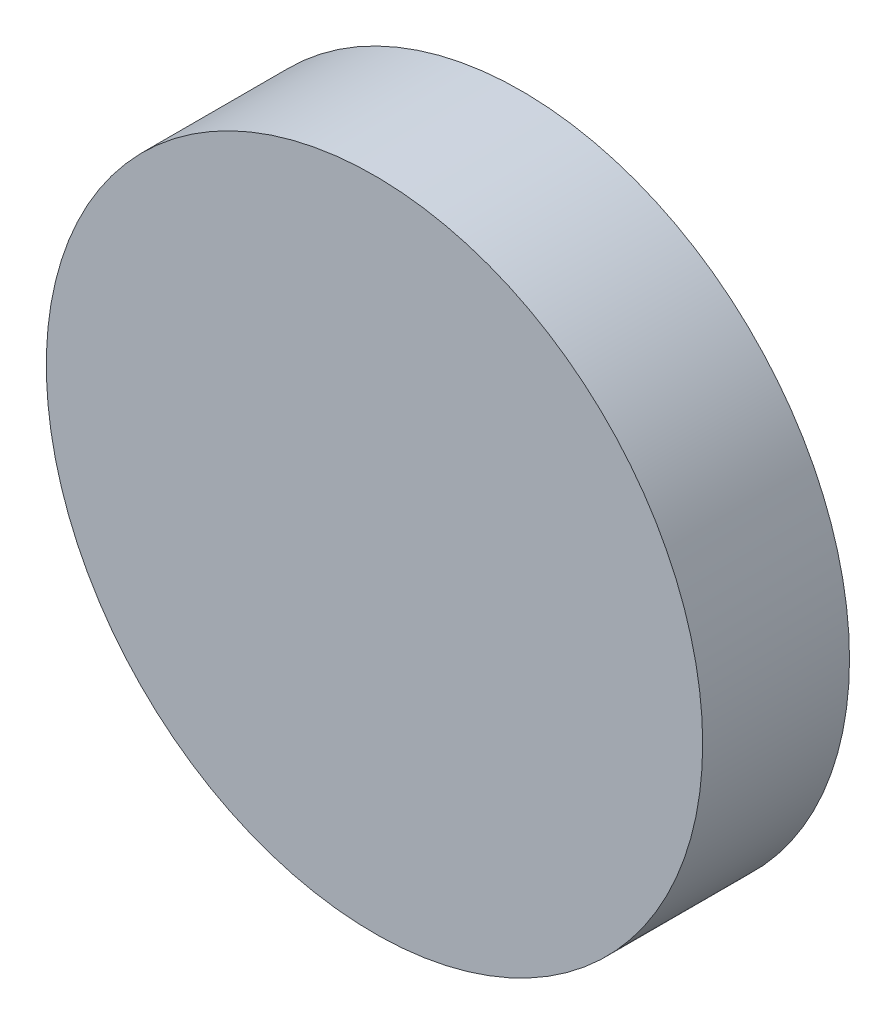
ISO-10303-21;
HEADER;
FILE_DESCRIPTION(('STEP AP214'),'2;1');
FILE_NAME('part.step','',(''),(''),'','','');
FILE_SCHEMA(('AUTOMOTIVE_DESIGN { 1 0 10303 214 1 1 1 1 }'));
ENDSEC;
DATA;
#1=APPLICATION_CONTEXT('core data for automotive mechanical design processes');
#2=APPLICATION_PROTOCOL_DEFINITION('international standard','automotive_design',2000,#1);
#3=PRODUCT_CONTEXT('',#1,'mechanical');
#4=PRODUCT('Part','Part','',(#3));
#5=PRODUCT_RELATED_PRODUCT_CATEGORY('part','',(#4));
#6=PRODUCT_DEFINITION_FORMATION('','',#4);
#7=PRODUCT_DEFINITION_CONTEXT('part definition',#1,'design');
#8=PRODUCT_DEFINITION('design','',#6,#7);
#9=PRODUCT_DEFINITION_SHAPE('','',#8);
#10=(LENGTH_UNIT() NAMED_UNIT(*) SI_UNIT(.MILLI.,.METRE.));
#11=(NAMED_UNIT(*) PLANE_ANGLE_UNIT() SI_UNIT($,.RADIAN.));
#12=(NAMED_UNIT(*) SI_UNIT($,.STERADIAN.) SOLID_ANGLE_UNIT());
#13=UNCERTAINTY_MEASURE_WITH_UNIT(LENGTH_MEASURE(1.E-05),#10,'distance_accuracy_value','');
#14=(GEOMETRIC_REPRESENTATION_CONTEXT(3) GLOBAL_UNCERTAINTY_ASSIGNED_CONTEXT((#13)) GLOBAL_UNIT_ASSIGNED_CONTEXT((#10,
#11,#12)) REPRESENTATION_CONTEXT('',''));
#15=CARTESIAN_POINT('',(0.,0.,0.));
#16=DIRECTION('',(0.,0.,1.));
#17=DIRECTION('',(1.,0.,0.));
#18=AXIS2_PLACEMENT_3D('',#15,#16,#17);
#19=CARTESIAN_POINT('',(0.,0.,127.5));
#20=DIRECTION('',(0.,0.,-1.));
#21=DIRECTION('',(-1.,0.,0.));
#22=AXIS2_PLACEMENT_3D('',#19,#20,#21);
#23=CYLINDRICAL_SURFACE('',#22,190.);
#24=CARTESIAN_POINT('',(0.,0.,127.5));
#25=DIRECTION('',(0.,0.,1.));
#26=DIRECTION('',(1.,0.,0.));
#27=AXIS2_PLACEMENT_3D('',#24,#25,#26);
#28=CIRCLE('',#27,190.);
#29=CARTESIAN_POINT('',(190.,0.,127.5));
#30=VERTEX_POINT('',#29);
#31=EDGE_CURVE('E10',#30,#30,#28,.T.);
#32=ORIENTED_EDGE('',*,*,#31,.F.);
#33=EDGE_LOOP('',(#32));
#34=FACE_BOUND('',#33,.T.);
#35=CARTESIAN_POINT('',(0.,0.,42.5));
#36=DIRECTION('',(0.,0.,1.));
#37=DIRECTION('',(1.,0.,0.));
#38=AXIS2_PLACEMENT_3D('',#35,#36,#37);
#39=CIRCLE('',#38,190.);
#40=CARTESIAN_POINT('',(190.,0.,42.5));
#41=VERTEX_POINT('',#40);
#42=EDGE_CURVE('E42',#41,#41,#39,.T.);
#43=ORIENTED_EDGE('',*,*,#42,.T.);
#44=EDGE_LOOP('',(#43));
#45=FACE_BOUND('',#44,.T.);
#46=ADVANCED_FACE('F39',(#34,#45),#23,.T.);
#47=CARTESIAN_POINT('',(0.,0.,127.5));
#48=DIRECTION('',(0.,0.,1.));
#49=DIRECTION('',(1.,0.,0.));
#50=AXIS2_PLACEMENT_3D('',#47,#48,#49);
#51=PLANE('',#50);
#52=ORIENTED_EDGE('',*,*,#31,.T.);
#53=EDGE_LOOP('',(#52));
#54=FACE_BOUND('',#53,.T.);
#55=ADVANCED_FACE('F54',(#54),#51,.T.);
#56=CARTESIAN_POINT('',(0.,0.,42.5));
#57=DIRECTION('',(0.,0.,1.));
#58=DIRECTION('',(1.,0.,0.));
#59=AXIS2_PLACEMENT_3D('',#56,#57,#58);
#60=PLANE('',#59);
#61=ORIENTED_EDGE('',*,*,#42,.F.);
#62=EDGE_LOOP('',(#61));
#63=FACE_BOUND('',#62,.T.);
#64=ADVANCED_FACE('F52',(#63),#60,.F.);
#65=CLOSED_SHELL('',(#46,#55,#64));
#66=MANIFOLD_SOLID_BREP('B2',#65);
#67=ADVANCED_BREP_SHAPE_REPRESENTATION('',(#18,#66),#14);
#68=SHAPE_DEFINITION_REPRESENTATION(#9,#67);
ENDSEC;
END-ISO-10303-21;
